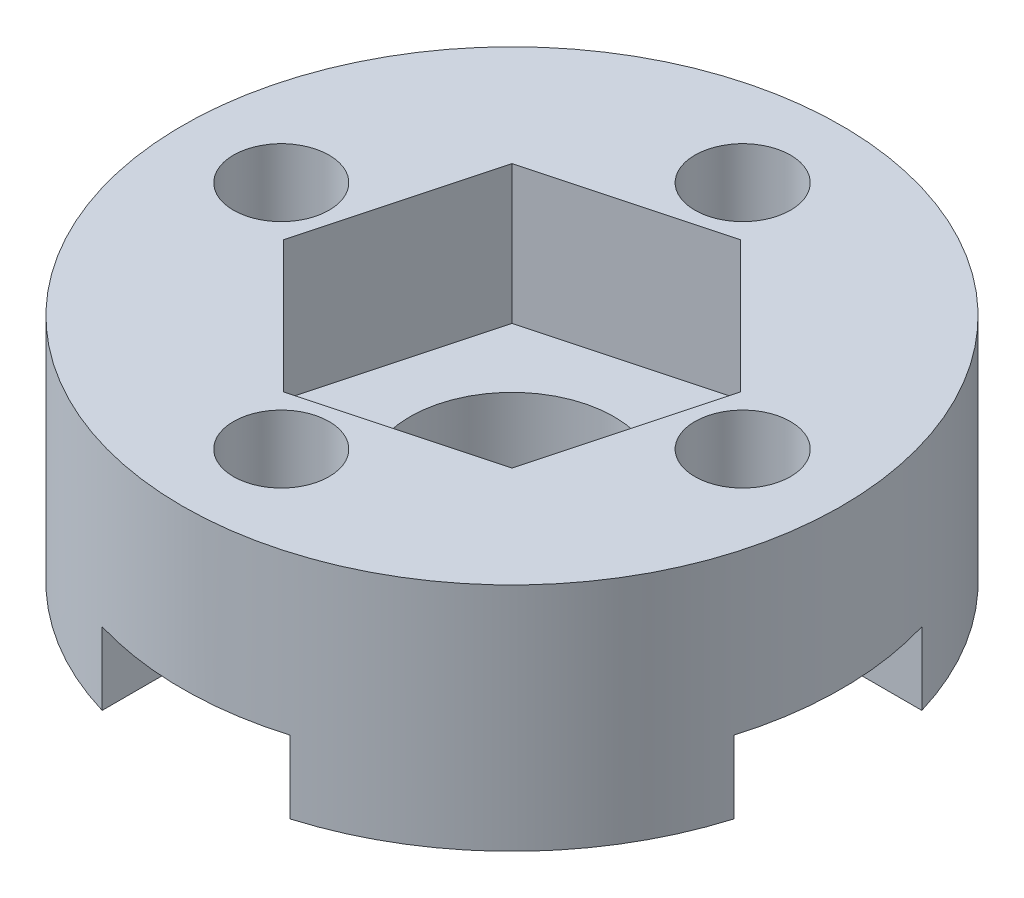
ISO-10303-21;
HEADER;
FILE_DESCRIPTION(('STEP AP214'),'2;1');
FILE_NAME('part.step','',(''),(''),'','','');
FILE_SCHEMA(('AUTOMOTIVE_DESIGN { 1 0 10303 214 1 1 1 1 }'));
ENDSEC;
DATA;
#1=APPLICATION_CONTEXT('core data for automotive mechanical design processes');
#2=APPLICATION_PROTOCOL_DEFINITION('international standard','automotive_design',2000,#1);
#3=PRODUCT_CONTEXT('',#1,'mechanical');
#4=PRODUCT('Part','Part','',(#3));
#5=PRODUCT_RELATED_PRODUCT_CATEGORY('part','',(#4));
#6=PRODUCT_DEFINITION_FORMATION('','',#4);
#7=PRODUCT_DEFINITION_CONTEXT('part definition',#1,'design');
#8=PRODUCT_DEFINITION('design','',#6,#7);
#9=PRODUCT_DEFINITION_SHAPE('','',#8);
#10=(LENGTH_UNIT() NAMED_UNIT(*) SI_UNIT(.MILLI.,.METRE.));
#11=(NAMED_UNIT(*) PLANE_ANGLE_UNIT() SI_UNIT($,.RADIAN.));
#12=(NAMED_UNIT(*) SI_UNIT($,.STERADIAN.) SOLID_ANGLE_UNIT());
#13=UNCERTAINTY_MEASURE_WITH_UNIT(LENGTH_MEASURE(1.E-05),#10,'distance_accuracy_value','');
#14=(GEOMETRIC_REPRESENTATION_CONTEXT(3) GLOBAL_UNCERTAINTY_ASSIGNED_CONTEXT((#13)) GLOBAL_UNIT_ASSIGNED_CONTEXT((#10,
#11,#12)) REPRESENTATION_CONTEXT('',''));
#15=CARTESIAN_POINT('',(0.,0.,0.));
#16=DIRECTION('',(0.,0.,1.));
#17=DIRECTION('',(1.,0.,0.));
#18=AXIS2_PLACEMENT_3D('',#15,#16,#17);
#19=CARTESIAN_POINT('',(0.,7.,0.));
#20=DIRECTION('',(0.,-1.,0.));
#21=DIRECTION('',(0.,0.,-1.));
#22=AXIS2_PLACEMENT_3D('',#19,#20,#21);
#23=CYLINDRICAL_SURFACE('',#22,3.1);
#24=CARTESIAN_POINT('',(0.,-1.,0.));
#25=DIRECTION('',(0.,-1.,0.));
#26=DIRECTION('',(0.,0.,-1.));
#27=AXIS2_PLACEMENT_3D('',#24,#25,#26);
#28=CIRCLE('',#27,3.1);
#29=CARTESIAN_POINT('',(0.,-1.,-3.1));
#30=VERTEX_POINT('',#29);
#31=EDGE_CURVE('E416',#30,#30,#28,.T.);
#32=ORIENTED_EDGE('',*,*,#31,.T.);
#33=EDGE_LOOP('',(#32));
#34=FACE_BOUND('',#33,.T.);
#35=CARTESIAN_POINT('',(0.,2.8,0.));
#36=DIRECTION('',(0.,1.,0.));
#37=DIRECTION('',(0.,0.,1.));
#38=AXIS2_PLACEMENT_3D('',#35,#36,#37);
#39=CIRCLE('',#38,3.1);
#40=CARTESIAN_POINT('',(0.,2.8,3.1));
#41=VERTEX_POINT('',#40);
#42=EDGE_CURVE('E36',#41,#41,#39,.T.);
#43=ORIENTED_EDGE('',*,*,#42,.T.);
#44=EDGE_LOOP('',(#43));
#45=FACE_BOUND('',#44,.T.);
#46=ADVANCED_FACE('F32',(#34,#45),#23,.F.);
#47=CARTESIAN_POINT('',(0.,0.,0.));
#48=DIRECTION('',(0.,1.,0.));
#49=DIRECTION('',(0.,0.,1.));
#50=AXIS2_PLACEMENT_3D('',#47,#48,#49);
#51=PLANE('',#50);
#52=DIRECTION('',(1.,0.,0.));
#53=VECTOR('',#52,1.);
#54=CARTESIAN_POINT('',(0.,0.,-2.85));
#55=LINE('',#54,#53);
#56=CARTESIAN_POINT('',(-9.58527516558604,0.,-2.8499999999999));
#57=VERTEX_POINT('',#56);
#58=CARTESIAN_POINT('',(-7.00000000000003,0.,-2.84999999999993));
#59=VERTEX_POINT('',#58);
#60=EDGE_CURVE('E414',#57,#59,#55,.T.);
#61=ORIENTED_EDGE('',*,*,#60,.F.);
#62=CARTESIAN_POINT('',(0.,0.,0.));
#63=DIRECTION('',(0.,1.,0.));
#64=DIRECTION('',(0.,0.,1.));
#65=AXIS2_PLACEMENT_3D('',#62,#63,#64);
#66=CIRCLE('',#65,10.);
#67=CARTESIAN_POINT('',(-2.85000000000007,0.,-9.58527516558599));
#68=VERTEX_POINT('',#67);
#69=EDGE_CURVE('E567',#68,#57,#66,.T.);
#70=ORIENTED_EDGE('',*,*,#69,.F.);
#71=DIRECTION('',(0.,0.,1.));
#72=VECTOR('',#71,1.);
#73=CARTESIAN_POINT('',(-2.85,0.,0.));
#74=LINE('',#73,#72);
#75=CARTESIAN_POINT('',(-2.85000000000005,0.,-6.99999999999998));
#76=VERTEX_POINT('',#75);
#77=EDGE_CURVE('E395',#68,#76,#74,.T.);
#78=ORIENTED_EDGE('',*,*,#77,.T.);
#79=CARTESIAN_POINT('',(0.,0.,-7.));
#80=DIRECTION('',(0.,1.,0.));
#81=DIRECTION('',(0.,0.,1.));
#82=AXIS2_PLACEMENT_3D('',#79,#80,#81);
#83=CIRCLE('',#82,2.85);
#84=CARTESIAN_POINT('',(-1.91425426413401,0.,-4.88857142857142));
#85=VERTEX_POINT('',#84);
#86=EDGE_CURVE('E384',#76,#85,#83,.T.);
#87=ORIENTED_EDGE('',*,*,#86,.T.);
#88=CARTESIAN_POINT('',(0.,0.,0.));
#89=DIRECTION('',(0.,1.,0.));
#90=DIRECTION('',(0.,0.,1.));
#91=AXIS2_PLACEMENT_3D('',#88,#89,#90);
#92=CIRCLE('',#91,5.25);
#93=CARTESIAN_POINT('',(-4.88857142857145,0.,-1.91425426413392));
#94=VERTEX_POINT('',#93);
#95=EDGE_CURVE('E449',#94,#85,#92,.F.);
#96=ORIENTED_EDGE('',*,*,#95,.F.);
#97=CARTESIAN_POINT('',(-7.,0.,0.));
#98=DIRECTION('',(0.,1.,0.));
#99=DIRECTION('',(0.,0.,1.));
#100=AXIS2_PLACEMENT_3D('',#97,#98,#99);
#101=CIRCLE('',#100,2.85);
#102=EDGE_CURVE('E391',#94,#59,#101,.T.);
#103=ORIENTED_EDGE('',*,*,#102,.T.);
#104=EDGE_LOOP('',(#61,#70,#78,#87,#96,#103));
#105=FACE_BOUND('',#104,.T.);
#106=ADVANCED_FACE('F566',(#105),#51,.F.);
#107=CARTESIAN_POINT('',(2.85,0.,9.58527516558601));
#108=VERTEX_POINT('',#107);
#109=CARTESIAN_POINT('',(9.58527516558602,0.,2.84999999999997));
#110=VERTEX_POINT('',#109);
#111=EDGE_CURVE('E441',#108,#110,#66,.T.);
#112=ORIENTED_EDGE('',*,*,#111,.F.);
#113=DIRECTION('',(0.,0.,-1.));
#114=VECTOR('',#113,1.);
#115=CARTESIAN_POINT('',(2.85,0.,0.));
#116=LINE('',#115,#114);
#117=CARTESIAN_POINT('',(2.85,0.,7.));
#118=VERTEX_POINT('',#117);
#119=EDGE_CURVE('E408',#108,#118,#116,.T.);
#120=ORIENTED_EDGE('',*,*,#119,.T.);
#121=CARTESIAN_POINT('',(0.,0.,7.));
#122=DIRECTION('',(0.,1.,0.));
#123=DIRECTION('',(0.,0.,1.));
#124=AXIS2_PLACEMENT_3D('',#121,#122,#123);
#125=CIRCLE('',#124,2.85);
#126=CARTESIAN_POINT('',(1.91425426413397,0.,4.88857142857143));
#127=VERTEX_POINT('',#126);
#128=EDGE_CURVE('E390',#118,#127,#125,.T.);
#129=ORIENTED_EDGE('',*,*,#128,.T.);
#130=CARTESIAN_POINT('',(4.88857142857144,0.,1.91425426413396));
#131=VERTEX_POINT('',#130);
#132=EDGE_CURVE('E440',#131,#127,#92,.F.);
#133=ORIENTED_EDGE('',*,*,#132,.F.);
#134=CARTESIAN_POINT('',(7.,0.,0.));
#135=DIRECTION('',(0.,1.,0.));
#136=DIRECTION('',(0.,0.,1.));
#137=AXIS2_PLACEMENT_3D('',#134,#135,#136);
#138=CIRCLE('',#137,2.85);
#139=CARTESIAN_POINT('',(7.00000000000001,0.,2.84999999999998));
#140=VERTEX_POINT('',#139);
#141=EDGE_CURVE('E57',#131,#140,#138,.T.);
#142=ORIENTED_EDGE('',*,*,#141,.T.);
#143=DIRECTION('',(-1.,0.,0.));
#144=VECTOR('',#143,1.);
#145=CARTESIAN_POINT('',(0.,0.,2.85));
#146=LINE('',#145,#144);
#147=EDGE_CURVE('E404',#110,#140,#146,.T.);
#148=ORIENTED_EDGE('',*,*,#147,.F.);
#149=EDGE_LOOP('',(#112,#120,#129,#133,#142,#148));
#150=FACE_BOUND('',#149,.T.);
#151=ADVANCED_FACE('F536',(#150),#51,.F.);
#152=CARTESIAN_POINT('',(-9.58527516558598,0.,2.8500000000001));
#153=VERTEX_POINT('',#152);
#154=CARTESIAN_POINT('',(-2.85,0.,9.58527516558601));
#155=VERTEX_POINT('',#154);
#156=EDGE_CURVE('E436',#153,#155,#66,.T.);
#157=ORIENTED_EDGE('',*,*,#156,.F.);
#158=DIRECTION('',(1.,0.,0.));
#159=VECTOR('',#158,1.);
#160=CARTESIAN_POINT('',(0.,0.,2.85));
#161=LINE('',#160,#159);
#162=CARTESIAN_POINT('',(-6.99999999999997,0.,2.85000000000007));
#163=VERTEX_POINT('',#162);
#164=EDGE_CURVE('E411',#153,#163,#161,.T.);
#165=ORIENTED_EDGE('',*,*,#164,.T.);
#166=CARTESIAN_POINT('',(-4.88857142857141,0.,1.91425426413403));
#167=VERTEX_POINT('',#166);
#168=EDGE_CURVE('E394',#163,#167,#101,.T.);
#169=ORIENTED_EDGE('',*,*,#168,.T.);
#170=CARTESIAN_POINT('',(-1.91425426413398,0.,4.88857142857143));
#171=VERTEX_POINT('',#170);
#172=EDGE_CURVE('E445',#171,#167,#92,.F.);
#173=ORIENTED_EDGE('',*,*,#172,.F.);
#174=CARTESIAN_POINT('',(-2.85,0.,7.));
#175=VERTEX_POINT('',#174);
#176=EDGE_CURVE('E387',#171,#175,#125,.T.);
#177=ORIENTED_EDGE('',*,*,#176,.T.);
#178=DIRECTION('',(0.,0.,-1.));
#179=VECTOR('',#178,1.);
#180=CARTESIAN_POINT('',(-2.85,0.,0.));
#181=LINE('',#180,#179);
#182=EDGE_CURVE('E406',#155,#175,#181,.T.);
#183=ORIENTED_EDGE('',*,*,#182,.F.);
#184=EDGE_LOOP('',(#157,#165,#169,#173,#177,#183));
#185=FACE_BOUND('',#184,.T.);
#186=ADVANCED_FACE('F553',(#185),#51,.F.);
#187=CARTESIAN_POINT('',(0.,7.,0.));
#188=DIRECTION('',(0.,-1.,0.));
#189=DIRECTION('',(0.,0.,-1.));
#190=AXIS2_PLACEMENT_3D('',#187,#188,#189);
#191=CYLINDRICAL_SURFACE('',#190,10.);
#192=CARTESIAN_POINT('',(0.,7.,0.));
#193=DIRECTION('',(0.,1.,0.));
#194=DIRECTION('',(0.,0.,1.));
#195=AXIS2_PLACEMENT_3D('',#192,#193,#194);
#196=CIRCLE('',#195,10.);
#197=CARTESIAN_POINT('',(0.,7.,10.));
#198=VERTEX_POINT('',#197);
#199=EDGE_CURVE('E437',#198,#198,#196,.T.);
#200=ORIENTED_EDGE('',*,*,#199,.F.);
#201=EDGE_LOOP('',(#200));
#202=FACE_BOUND('',#201,.T.);
#203=DIRECTION('',(0.,-1.,0.));
#204=VECTOR('',#203,1.);
#205=CARTESIAN_POINT('',(-9.58527516558604,2.2,-2.8499999999999));
#206=LINE('',#205,#204);
#207=CARTESIAN_POINT('',(-9.58527516558604,2.2,-2.8499999999999));
#208=VERTEX_POINT('',#207);
#209=EDGE_CURVE('E301',#208,#57,#206,.T.);
#210=ORIENTED_EDGE('',*,*,#209,.F.);
#211=CARTESIAN_POINT('',(0.,2.2,0.));
#212=DIRECTION('',(0.,-1.,0.));
#213=DIRECTION('',(0.,0.,-1.));
#214=AXIS2_PLACEMENT_3D('',#211,#212,#213);
#215=CIRCLE('',#214,10.);
#216=CARTESIAN_POINT('',(-9.58527516558598,2.2,2.8500000000001));
#217=VERTEX_POINT('',#216);
#218=EDGE_CURVE('E295',#217,#208,#215,.T.);
#219=ORIENTED_EDGE('',*,*,#218,.F.);
#220=DIRECTION('',(0.,-1.,0.));
#221=VECTOR('',#220,1.);
#222=CARTESIAN_POINT('',(-9.58527516558598,2.2,2.8500000000001));
#223=LINE('',#222,#221);
#224=EDGE_CURVE('E304',#217,#153,#223,.T.);
#225=ORIENTED_EDGE('',*,*,#224,.T.);
#226=ORIENTED_EDGE('',*,*,#156,.T.);
#227=DIRECTION('',(0.,-1.,0.));
#228=VECTOR('',#227,1.);
#229=CARTESIAN_POINT('',(-2.85,2.2,9.58527516558601));
#230=LINE('',#229,#228);
#231=CARTESIAN_POINT('',(-2.85,2.2,9.58527516558601));
#232=VERTEX_POINT('',#231);
#233=EDGE_CURVE('E332',#232,#155,#230,.T.);
#234=ORIENTED_EDGE('',*,*,#233,.F.);
#235=CARTESIAN_POINT('',(0.,2.2,0.));
#236=DIRECTION('',(0.,-1.,0.));
#237=DIRECTION('',(0.,0.,-1.));
#238=AXIS2_PLACEMENT_3D('',#235,#236,#237);
#239=CIRCLE('',#238,10.);
#240=CARTESIAN_POINT('',(2.85,2.2,9.58527516558601));
#241=VERTEX_POINT('',#240);
#242=EDGE_CURVE('E315',#241,#232,#239,.T.);
#243=ORIENTED_EDGE('',*,*,#242,.F.);
#244=DIRECTION('',(0.,-1.,0.));
#245=VECTOR('',#244,1.);
#246=CARTESIAN_POINT('',(2.85,2.2,9.58527516558601));
#247=LINE('',#246,#245);
#248=EDGE_CURVE('E324',#241,#108,#247,.T.);
#249=ORIENTED_EDGE('',*,*,#248,.T.);
#250=ORIENTED_EDGE('',*,*,#111,.T.);
#251=DIRECTION('',(0.,-1.,0.));
#252=VECTOR('',#251,1.);
#253=CARTESIAN_POINT('',(9.58527516558602,2.2,2.84999999999997));
#254=LINE('',#253,#252);
#255=CARTESIAN_POINT('',(9.58527516558602,2.2,2.84999999999997));
#256=VERTEX_POINT('',#255);
#257=EDGE_CURVE('E326',#256,#110,#254,.T.);
#258=ORIENTED_EDGE('',*,*,#257,.F.);
#259=CARTESIAN_POINT('',(0.,2.2,0.));
#260=DIRECTION('',(0.,-1.,0.));
#261=DIRECTION('',(0.,0.,-1.));
#262=AXIS2_PLACEMENT_3D('',#259,#260,#261);
#263=CIRCLE('',#262,10.);
#264=CARTESIAN_POINT('',(9.585275165586,2.2,-2.85000000000003));
#265=VERTEX_POINT('',#264);
#266=EDGE_CURVE('E345',#265,#256,#263,.T.);
#267=ORIENTED_EDGE('',*,*,#266,.F.);
#268=DIRECTION('',(0.,-1.,0.));
#269=VECTOR('',#268,1.);
#270=CARTESIAN_POINT('',(9.585275165586,2.2,-2.85000000000003));
#271=LINE('',#270,#269);
#272=CARTESIAN_POINT('',(9.585275165586,0.,-2.85000000000003));
#273=VERTEX_POINT('',#272);
#274=EDGE_CURVE('E352',#265,#273,#271,.T.);
#275=ORIENTED_EDGE('',*,*,#274,.T.);
#276=CARTESIAN_POINT('',(2.84999999999993,0.,-9.58527516558603));
#277=VERTEX_POINT('',#276);
#278=EDGE_CURVE('E444',#273,#277,#66,.T.);
#279=ORIENTED_EDGE('',*,*,#278,.T.);
#280=DIRECTION('',(0.,-1.,0.));
#281=VECTOR('',#280,1.);
#282=CARTESIAN_POINT('',(2.84999999999993,2.2,-9.58527516558603));
#283=LINE('',#282,#281);
#284=CARTESIAN_POINT('',(2.84999999999993,2.2,-9.58527516558603));
#285=VERTEX_POINT('',#284);
#286=EDGE_CURVE('E350',#285,#277,#283,.T.);
#287=ORIENTED_EDGE('',*,*,#286,.F.);
#288=CARTESIAN_POINT('',(0.,2.2,0.));
#289=DIRECTION('',(0.,-1.,0.));
#290=DIRECTION('',(0.,0.,-1.));
#291=AXIS2_PLACEMENT_3D('',#288,#289,#290);
#292=CIRCLE('',#291,10.);
#293=CARTESIAN_POINT('',(-2.85000000000007,2.2,-9.58527516558599));
#294=VERTEX_POINT('',#293);
#295=EDGE_CURVE('E368',#294,#285,#292,.T.);
#296=ORIENTED_EDGE('',*,*,#295,.F.);
#297=DIRECTION('',(0.,-1.,0.));
#298=VECTOR('',#297,1.);
#299=CARTESIAN_POINT('',(-2.85000000000007,2.2,-9.58527516558599));
#300=LINE('',#299,#298);
#301=EDGE_CURVE('E374',#294,#68,#300,.T.);
#302=ORIENTED_EDGE('',*,*,#301,.T.);
#303=ORIENTED_EDGE('',*,*,#69,.T.);
#304=EDGE_LOOP('',(#210,#219,#225,#226,#234,#243,#249,#250,#258,#267,#275,#279,#287,#296,#302,#303));
#305=FACE_BOUND('',#304,.T.);
#306=ADVANCED_FACE('F34',(#202,#305),#191,.T.);
#307=CARTESIAN_POINT('',(0.,7.,-7.));
#308=DIRECTION('',(0.,-1.,0.));
#309=DIRECTION('',(0.,0.,-1.));
#310=AXIS2_PLACEMENT_3D('',#307,#308,#309);
#311=CYLINDRICAL_SURFACE('',#310,1.45);
#312=CARTESIAN_POINT('',(0.,7.,-7.));
#313=DIRECTION('',(0.,1.,0.));
#314=DIRECTION('',(0.,0.,1.));
#315=AXIS2_PLACEMENT_3D('',#312,#313,#314);
#316=CIRCLE('',#315,1.45);
#317=CARTESIAN_POINT('',(0.,7.,-5.55));
#318=VERTEX_POINT('',#317);
#319=EDGE_CURVE('E433',#318,#318,#316,.T.);
#320=ORIENTED_EDGE('',*,*,#319,.T.);
#321=EDGE_LOOP('',(#320));
#322=FACE_BOUND('',#321,.T.);
#323=CARTESIAN_POINT('',(0.,2.2,-7.));
#324=DIRECTION('',(0.,-1.,0.));
#325=DIRECTION('',(0.,0.,-1.));
#326=AXIS2_PLACEMENT_3D('',#323,#324,#325);
#327=CIRCLE('',#326,1.45);
#328=CARTESIAN_POINT('',(0.,2.2,-8.45));
#329=VERTEX_POINT('',#328);
#330=EDGE_CURVE('E399',#329,#329,#327,.T.);
#331=ORIENTED_EDGE('',*,*,#330,.T.);
#332=EDGE_LOOP('',(#331));
#333=FACE_BOUND('',#332,.T.);
#334=ADVANCED_FACE('F479',(#322,#333),#311,.F.);
#335=CARTESIAN_POINT('',(7.,7.,0.));
#336=DIRECTION('',(0.,-1.,0.));
#337=DIRECTION('',(0.,0.,-1.));
#338=AXIS2_PLACEMENT_3D('',#335,#336,#337);
#339=CYLINDRICAL_SURFACE('',#338,1.45);
#340=CARTESIAN_POINT('',(7.,7.,0.));
#341=DIRECTION('',(0.,1.,0.));
#342=DIRECTION('',(0.,0.,1.));
#343=AXIS2_PLACEMENT_3D('',#340,#341,#342);
#344=CIRCLE('',#343,1.45);
#345=CARTESIAN_POINT('',(7.,7.,1.45));
#346=VERTEX_POINT('',#345);
#347=EDGE_CURVE('E430',#346,#346,#344,.T.);
#348=ORIENTED_EDGE('',*,*,#347,.T.);
#349=EDGE_LOOP('',(#348));
#350=FACE_BOUND('',#349,.T.);
#351=CARTESIAN_POINT('',(7.,2.2,0.));
#352=DIRECTION('',(0.,-1.,0.));
#353=DIRECTION('',(0.,0.,-1.));
#354=AXIS2_PLACEMENT_3D('',#351,#352,#353);
#355=CIRCLE('',#354,1.45);
#356=CARTESIAN_POINT('',(7.,2.2,-1.45));
#357=VERTEX_POINT('',#356);
#358=EDGE_CURVE('E474',#357,#357,#355,.T.);
#359=ORIENTED_EDGE('',*,*,#358,.T.);
#360=EDGE_LOOP('',(#359));
#361=FACE_BOUND('',#360,.T.);
#362=ADVANCED_FACE('F853',(#350,#361),#339,.F.);
#363=CARTESIAN_POINT('',(0.,7.,7.));
#364=DIRECTION('',(0.,-1.,0.));
#365=DIRECTION('',(0.,0.,-1.));
#366=AXIS2_PLACEMENT_3D('',#363,#364,#365);
#367=CYLINDRICAL_SURFACE('',#366,1.45);
#368=CARTESIAN_POINT('',(0.,7.,7.));
#369=DIRECTION('',(0.,1.,0.));
#370=DIRECTION('',(0.,0.,1.));
#371=AXIS2_PLACEMENT_3D('',#368,#369,#370);
#372=CIRCLE('',#371,1.45);
#373=CARTESIAN_POINT('',(0.,7.,8.45));
#374=VERTEX_POINT('',#373);
#375=EDGE_CURVE('E427',#374,#374,#372,.T.);
#376=ORIENTED_EDGE('',*,*,#375,.T.);
#377=EDGE_LOOP('',(#376));
#378=FACE_BOUND('',#377,.T.);
#379=CARTESIAN_POINT('',(0.,2.2,7.));
#380=DIRECTION('',(0.,-1.,0.));
#381=DIRECTION('',(0.,0.,-1.));
#382=AXIS2_PLACEMENT_3D('',#379,#380,#381);
#383=CIRCLE('',#382,1.45);
#384=CARTESIAN_POINT('',(0.,2.2,5.55));
#385=VERTEX_POINT('',#384);
#386=EDGE_CURVE('E471',#385,#385,#383,.T.);
#387=ORIENTED_EDGE('',*,*,#386,.T.);
#388=EDGE_LOOP('',(#387));
#389=FACE_BOUND('',#388,.T.);
#390=ADVANCED_FACE('F846',(#378,#389),#367,.F.);
#391=CARTESIAN_POINT('',(-7.,7.,0.));
#392=DIRECTION('',(0.,-1.,0.));
#393=DIRECTION('',(0.,0.,-1.));
#394=AXIS2_PLACEMENT_3D('',#391,#392,#393);
#395=CYLINDRICAL_SURFACE('',#394,1.45);
#396=CARTESIAN_POINT('',(-7.,7.,0.));
#397=DIRECTION('',(0.,1.,0.));
#398=DIRECTION('',(0.,0.,1.));
#399=AXIS2_PLACEMENT_3D('',#396,#397,#398);
#400=CIRCLE('',#399,1.45);
#401=CARTESIAN_POINT('',(-7.,7.,1.45));
#402=VERTEX_POINT('',#401);
#403=EDGE_CURVE('E423',#402,#402,#400,.T.);
#404=ORIENTED_EDGE('',*,*,#403,.T.);
#405=EDGE_LOOP('',(#404));
#406=FACE_BOUND('',#405,.T.);
#407=CARTESIAN_POINT('',(-7.,2.2,0.));
#408=DIRECTION('',(0.,-1.,0.));
#409=DIRECTION('',(0.,0.,-1.));
#410=AXIS2_PLACEMENT_3D('',#407,#408,#409);
#411=CIRCLE('',#410,1.45);
#412=CARTESIAN_POINT('',(-7.,2.2,-1.45));
#413=VERTEX_POINT('',#412);
#414=EDGE_CURVE('E468',#413,#413,#411,.T.);
#415=ORIENTED_EDGE('',*,*,#414,.T.);
#416=EDGE_LOOP('',(#415));
#417=FACE_BOUND('',#416,.T.);
#418=ADVANCED_FACE('F843',(#406,#417),#395,.F.);
#419=CARTESIAN_POINT('',(0.,-1.,0.));
#420=DIRECTION('',(0.,1.,0.));
#421=DIRECTION('',(0.,0.,1.));
#422=AXIS2_PLACEMENT_3D('',#419,#420,#421);
#423=CYLINDRICAL_SURFACE('',#422,5.25);
#424=ORIENTED_EDGE('',*,*,#172,.T.);
#425=DIRECTION('',(0.,-1.,0.));
#426=VECTOR('',#425,1.);
#427=CARTESIAN_POINT('',(-4.88857142857141,-0.5,1.91425426413403));
#428=LINE('',#427,#426);
#429=CARTESIAN_POINT('',(-4.88857142857141,-1.,1.91425426413403));
#430=VERTEX_POINT('',#429);
#431=EDGE_CURVE('E11',#167,#430,#428,.T.);
#432=ORIENTED_EDGE('',*,*,#431,.T.);
#433=CARTESIAN_POINT('',(0.,-1.,0.));
#434=DIRECTION('',(0.,-1.,0.));
#435=DIRECTION('',(0.,0.,-1.));
#436=AXIS2_PLACEMENT_3D('',#433,#434,#435);
#437=CIRCLE('',#436,5.25);
#438=CARTESIAN_POINT('',(-1.91425426413397,-1.,4.88857142857143));
#439=VERTEX_POINT('',#438);
#440=EDGE_CURVE('E560',#439,#430,#437,.T.);
#441=ORIENTED_EDGE('',*,*,#440,.F.);
#442=DIRECTION('',(0.,-1.,0.));
#443=VECTOR('',#442,1.);
#444=CARTESIAN_POINT('',(-1.91425426413397,-0.5,4.88857142857143));
#445=LINE('',#444,#443);
#446=EDGE_CURVE('E460',#439,#171,#445,.F.);
#447=ORIENTED_EDGE('',*,*,#446,.T.);
#448=EDGE_LOOP('',(#424,#432,#441,#447));
#449=FACE_BOUND('',#448,.T.);
#450=ADVANCED_FACE('F557',(#449),#423,.T.);
#451=ORIENTED_EDGE('',*,*,#132,.T.);
#452=DIRECTION('',(0.,-1.,0.));
#453=VECTOR('',#452,1.);
#454=CARTESIAN_POINT('',(1.91425426413397,-0.5,4.88857142857143));
#455=LINE('',#454,#453);
#456=CARTESIAN_POINT('',(1.91425426413398,-1.,4.88857142857143));
#457=VERTEX_POINT('',#456);
#458=EDGE_CURVE('E463',#127,#457,#455,.T.);
#459=ORIENTED_EDGE('',*,*,#458,.T.);
#460=CARTESIAN_POINT('',(4.88857142857144,-1.,1.91425426413396));
#461=VERTEX_POINT('',#460);
#462=EDGE_CURVE('E424',#461,#457,#437,.T.);
#463=ORIENTED_EDGE('',*,*,#462,.F.);
#464=DIRECTION('',(0.,-1.,0.));
#465=VECTOR('',#464,1.);
#466=CARTESIAN_POINT('',(4.88857142857144,-0.5,1.91425426413396));
#467=LINE('',#466,#465);
#468=EDGE_CURVE('E455',#461,#131,#467,.F.);
#469=ORIENTED_EDGE('',*,*,#468,.T.);
#470=EDGE_LOOP('',(#451,#459,#463,#469));
#471=FACE_BOUND('',#470,.T.);
#472=ADVANCED_FACE('F532',(#471),#423,.T.);
#473=CARTESIAN_POINT('',(1.91425426413394,0.,-4.88857142857144));
#474=VERTEX_POINT('',#473);
#475=CARTESIAN_POINT('',(4.88857142857142,0.,-1.91425426413399));
#476=VERTEX_POINT('',#475);
#477=EDGE_CURVE('E510',#474,#476,#92,.F.);
#478=ORIENTED_EDGE('',*,*,#477,.T.);
#479=DIRECTION('',(0.,-1.,0.));
#480=VECTOR('',#479,1.);
#481=CARTESIAN_POINT('',(4.88857142857142,-0.5,-1.91425426413399));
#482=LINE('',#481,#480);
#483=CARTESIAN_POINT('',(4.88857142857142,-1.,-1.91425426413399));
#484=VERTEX_POINT('',#483);
#485=EDGE_CURVE('E457',#476,#484,#482,.T.);
#486=ORIENTED_EDGE('',*,*,#485,.T.);
#487=CARTESIAN_POINT('',(1.91425426413394,-1.,-4.88857142857144));
#488=VERTEX_POINT('',#487);
#489=EDGE_CURVE('E420',#488,#484,#437,.T.);
#490=ORIENTED_EDGE('',*,*,#489,.F.);
#491=DIRECTION('',(0.,-1.,0.));
#492=VECTOR('',#491,1.);
#493=CARTESIAN_POINT('',(1.91425426413394,-0.5,-4.88857142857144));
#494=LINE('',#493,#492);
#495=EDGE_CURVE('E448',#488,#474,#494,.F.);
#496=ORIENTED_EDGE('',*,*,#495,.T.);
#497=EDGE_LOOP('',(#478,#486,#490,#496));
#498=FACE_BOUND('',#497,.T.);
#499=ADVANCED_FACE('F514',(#498),#423,.T.);
#500=ORIENTED_EDGE('',*,*,#278,.F.);
#501=DIRECTION('',(-1.,0.,0.));
#502=VECTOR('',#501,1.);
#503=CARTESIAN_POINT('',(0.,0.,-2.85));
#504=LINE('',#503,#502);
#505=CARTESIAN_POINT('',(6.99999999999999,0.,-2.85000000000003));
#506=VERTEX_POINT('',#505);
#507=EDGE_CURVE('E401',#273,#506,#504,.T.);
#508=ORIENTED_EDGE('',*,*,#507,.T.);
#509=EDGE_CURVE('E386',#506,#476,#138,.T.);
#510=ORIENTED_EDGE('',*,*,#509,.T.);
#511=ORIENTED_EDGE('',*,*,#477,.F.);
#512=CARTESIAN_POINT('',(2.84999999999995,0.,-7.00000000000002));
#513=VERTEX_POINT('',#512);
#514=EDGE_CURVE('E303',#474,#513,#83,.T.);
#515=ORIENTED_EDGE('',*,*,#514,.T.);
#516=DIRECTION('',(0.,0.,1.));
#517=VECTOR('',#516,1.);
#518=CARTESIAN_POINT('',(2.85,0.,0.));
#519=LINE('',#518,#517);
#520=EDGE_CURVE('E398',#277,#513,#519,.T.);
#521=ORIENTED_EDGE('',*,*,#520,.F.);
#522=EDGE_LOOP('',(#500,#508,#510,#511,#515,#521));
#523=FACE_BOUND('',#522,.T.);
#524=ADVANCED_FACE('F506',(#523),#51,.F.);
#525=CARTESIAN_POINT('',(0.,7.,0.));
#526=DIRECTION('',(0.,1.,0.));
#527=DIRECTION('',(0.,0.,1.));
#528=AXIS2_PLACEMENT_3D('',#525,#526,#527);
#529=PLANE('',#528);
#530=DIRECTION('',(-0.707106781186548,0.,-0.707106781186547));
#531=VECTOR('',#530,1.);
#532=CARTESIAN_POINT('',(5.46523985108701,7.,-1.46440660454116));
#533=LINE('',#532,#531);
#534=CARTESIAN_POINT('',(5.46523985108701,7.,-1.46440660454116));
#535=VERTEX_POINT('',#534);
#536=CARTESIAN_POINT('',(1.46440660454115,7.,-5.46523985108701));
#537=VERTEX_POINT('',#536);
#538=EDGE_CURVE('E49',#535,#537,#533,.T.);
#539=ORIENTED_EDGE('',*,*,#538,.F.);
#540=DIRECTION('',(0.25881904510252,0.,-0.965925826289069));
#541=VECTOR('',#540,1.);
#542=CARTESIAN_POINT('',(4.00083324654586,7.,4.00083324654585));
#543=LINE('',#542,#541);
#544=CARTESIAN_POINT('',(4.00083324654586,7.,4.00083324654585));
#545=VERTEX_POINT('',#544);
#546=EDGE_CURVE('E253',#545,#535,#543,.T.);
#547=ORIENTED_EDGE('',*,*,#546,.F.);
#548=DIRECTION('',(0.965925826289068,0.,-0.258819045102522));
#549=VECTOR('',#548,1.);
#550=CARTESIAN_POINT('',(-1.46440660454115,7.,5.46523985108701));
#551=LINE('',#550,#549);
#552=CARTESIAN_POINT('',(-1.46440660454115,7.,5.46523985108701));
#553=VERTEX_POINT('',#552);
#554=EDGE_CURVE('E256',#553,#545,#551,.T.);
#555=ORIENTED_EDGE('',*,*,#554,.F.);
#556=DIRECTION('',(0.707106781186548,0.,0.707106781186547));
#557=VECTOR('',#556,1.);
#558=CARTESIAN_POINT('',(-5.46523985108701,7.,1.46440660454116));
#559=LINE('',#558,#557);
#560=CARTESIAN_POINT('',(-5.46523985108701,7.,1.46440660454116));
#561=VERTEX_POINT('',#560);
#562=EDGE_CURVE('E272',#561,#553,#559,.T.);
#563=ORIENTED_EDGE('',*,*,#562,.F.);
#564=DIRECTION('',(-0.25881904510252,0.,0.965925826289069));
#565=VECTOR('',#564,1.);
#566=CARTESIAN_POINT('',(-4.00083324654586,7.,-4.00083324654585));
#567=LINE('',#566,#565);
#568=CARTESIAN_POINT('',(-4.00083324654586,7.,-4.00083324654585));
#569=VERTEX_POINT('',#568);
#570=EDGE_CURVE('E269',#569,#561,#567,.T.);
#571=ORIENTED_EDGE('',*,*,#570,.F.);
#572=DIRECTION('',(-0.965925826289068,0.,0.258819045102522));
#573=VECTOR('',#572,1.);
#574=CARTESIAN_POINT('',(1.46440660454115,7.,-5.46523985108702));
#575=LINE('',#574,#573);
#576=EDGE_CURVE('E267',#537,#569,#575,.T.);
#577=ORIENTED_EDGE('',*,*,#576,.F.);
#578=EDGE_LOOP('',(#539,#547,#555,#563,#571,#577));
#579=FACE_BOUND('',#578,.T.);
#580=ORIENTED_EDGE('',*,*,#375,.F.);
#581=EDGE_LOOP('',(#580));
#582=FACE_BOUND('',#581,.T.);
#583=ORIENTED_EDGE('',*,*,#319,.F.);
#584=EDGE_LOOP('',(#583));
#585=FACE_BOUND('',#584,.T.);
#586=ORIENTED_EDGE('',*,*,#199,.T.);
#587=EDGE_LOOP('',(#586));
#588=FACE_BOUND('',#587,.T.);
#589=ORIENTED_EDGE('',*,*,#347,.F.);
#590=EDGE_LOOP('',(#589));
#591=FACE_BOUND('',#590,.T.);
#592=ORIENTED_EDGE('',*,*,#403,.F.);
#593=EDGE_LOOP('',(#592));
#594=FACE_BOUND('',#593,.T.);
#595=ADVANCED_FACE('F598',(#579,#582,#585,#588,#591,#594),#529,.T.);
#596=CARTESIAN_POINT('',(0.,-1.,0.));
#597=DIRECTION('',(0.,-1.,0.));
#598=DIRECTION('',(0.,0.,-1.));
#599=AXIS2_PLACEMENT_3D('',#596,#597,#598);
#600=PLANE('',#599);
#601=CARTESIAN_POINT('',(-7.,-1.,0.));
#602=DIRECTION('',(0.,-1.,0.));
#603=DIRECTION('',(0.,0.,-1.));
#604=AXIS2_PLACEMENT_3D('',#601,#602,#603);
#605=CIRCLE('',#604,2.85);
#606=CARTESIAN_POINT('',(-4.88857142857145,-1.,-1.91425426413392));
#607=VERTEX_POINT('',#606);
#608=EDGE_CURVE('E289',#607,#430,#605,.T.);
#609=ORIENTED_EDGE('',*,*,#608,.F.);
#610=CARTESIAN_POINT('',(-1.91425426413401,-1.,-4.88857142857141));
#611=VERTEX_POINT('',#610);
#612=EDGE_CURVE('E419',#607,#611,#437,.T.);
#613=ORIENTED_EDGE('',*,*,#612,.T.);
#614=CARTESIAN_POINT('',(0.,-1.,-7.));
#615=DIRECTION('',(0.,-1.,0.));
#616=DIRECTION('',(0.,0.,-1.));
#617=AXIS2_PLACEMENT_3D('',#614,#615,#616);
#618=CIRCLE('',#617,2.85);
#619=EDGE_CURVE('E362',#488,#611,#618,.T.);
#620=ORIENTED_EDGE('',*,*,#619,.F.);
#621=ORIENTED_EDGE('',*,*,#489,.T.);
#622=CARTESIAN_POINT('',(7.,-1.,0.));
#623=DIRECTION('',(0.,-1.,0.));
#624=DIRECTION('',(0.,0.,-1.));
#625=AXIS2_PLACEMENT_3D('',#622,#623,#624);
#626=CIRCLE('',#625,2.85);
#627=EDGE_CURVE('E339',#461,#484,#626,.T.);
#628=ORIENTED_EDGE('',*,*,#627,.F.);
#629=ORIENTED_EDGE('',*,*,#462,.T.);
#630=CARTESIAN_POINT('',(0.,-1.,7.));
#631=DIRECTION('',(0.,-1.,0.));
#632=DIRECTION('',(0.,0.,-1.));
#633=AXIS2_PLACEMENT_3D('',#630,#631,#632);
#634=CIRCLE('',#633,2.85);
#635=EDGE_CURVE('E316',#439,#457,#634,.T.);
#636=ORIENTED_EDGE('',*,*,#635,.F.);
#637=ORIENTED_EDGE('',*,*,#440,.T.);
#638=EDGE_LOOP('',(#609,#613,#620,#621,#628,#629,#636,#637));
#639=FACE_BOUND('',#638,.T.);
#640=ORIENTED_EDGE('',*,*,#31,.F.);
#641=EDGE_LOOP('',(#640));
#642=FACE_BOUND('',#641,.T.);
#643=ADVANCED_FACE('F518',(#639,#642),#600,.T.);
#644=ORIENTED_EDGE('',*,*,#612,.F.);
#645=DIRECTION('',(0.,-1.,0.));
#646=VECTOR('',#645,1.);
#647=CARTESIAN_POINT('',(-4.88857142857145,-0.5,-1.91425426413392));
#648=LINE('',#647,#646);
#649=EDGE_CURVE('E41',#607,#94,#648,.F.);
#650=ORIENTED_EDGE('',*,*,#649,.T.);
#651=ORIENTED_EDGE('',*,*,#95,.T.);
#652=DIRECTION('',(0.,-1.,0.));
#653=VECTOR('',#652,1.);
#654=CARTESIAN_POINT('',(-1.91425426413401,-0.5,-4.88857142857141));
#655=LINE('',#654,#653);
#656=EDGE_CURVE('E452',#85,#611,#655,.T.);
#657=ORIENTED_EDGE('',*,*,#656,.T.);
#658=EDGE_LOOP('',(#644,#650,#651,#657));
#659=FACE_BOUND('',#658,.T.);
#660=ADVANCED_FACE('F526',(#659),#423,.T.);
#661=CARTESIAN_POINT('',(2.85,2.2,0.));
#662=DIRECTION('',(-1.,0.,0.));
#663=DIRECTION('',(0.,0.,1.));
#664=AXIS2_PLACEMENT_3D('',#661,#662,#663);
#665=PLANE('',#664);
#666=ORIENTED_EDGE('',*,*,#520,.T.);
#667=DIRECTION('',(0.,-1.,0.));
#668=VECTOR('',#667,1.);
#669=CARTESIAN_POINT('',(2.84999999999995,2.2,-7.00000000000002));
#670=LINE('',#669,#668);
#671=CARTESIAN_POINT('',(2.84999999999995,2.2,-7.00000000000002));
#672=VERTEX_POINT('',#671);
#673=EDGE_CURVE('E371',#672,#513,#670,.T.);
#674=ORIENTED_EDGE('',*,*,#673,.F.);
#675=DIRECTION('',(0.,0.,-1.));
#676=VECTOR('',#675,1.);
#677=CARTESIAN_POINT('',(2.85,2.2,0.));
#678=LINE('',#677,#676);
#679=EDGE_CURVE('E359',#672,#285,#678,.T.);
#680=ORIENTED_EDGE('',*,*,#679,.T.);
#681=ORIENTED_EDGE('',*,*,#286,.T.);
#682=EDGE_LOOP('',(#666,#674,#680,#681));
#683=FACE_BOUND('',#682,.T.);
#684=ADVANCED_FACE('F504',(#683),#665,.T.);
#685=CARTESIAN_POINT('',(-2.85,2.2,0.));
#686=DIRECTION('',(-1.,0.,0.));
#687=DIRECTION('',(0.,0.,1.));
#688=AXIS2_PLACEMENT_3D('',#685,#686,#687);
#689=PLANE('',#688);
#690=ORIENTED_EDGE('',*,*,#301,.F.);
#691=DIRECTION('',(0.,0.,-1.));
#692=VECTOR('',#691,1.);
#693=CARTESIAN_POINT('',(-2.85,2.2,0.));
#694=LINE('',#693,#692);
#695=CARTESIAN_POINT('',(-2.85000000000005,2.2,-6.99999999999998));
#696=VERTEX_POINT('',#695);
#697=EDGE_CURVE('E365',#696,#294,#694,.T.);
#698=ORIENTED_EDGE('',*,*,#697,.F.);
#699=DIRECTION('',(0.,-1.,0.));
#700=VECTOR('',#699,1.);
#701=CARTESIAN_POINT('',(-2.85000000000005,2.2,-6.99999999999998));
#702=LINE('',#701,#700);
#703=EDGE_CURVE('E377',#696,#76,#702,.T.);
#704=ORIENTED_EDGE('',*,*,#703,.T.);
#705=ORIENTED_EDGE('',*,*,#77,.F.);
#706=EDGE_LOOP('',(#690,#698,#704,#705));
#707=FACE_BOUND('',#706,.T.);
#708=ADVANCED_FACE('F496',(#707),#689,.F.);
#709=CARTESIAN_POINT('',(0.,2.2,-7.));
#710=DIRECTION('',(0.,-1.,0.));
#711=DIRECTION('',(0.,0.,-1.));
#712=AXIS2_PLACEMENT_3D('',#709,#710,#711);
#713=CYLINDRICAL_SURFACE('',#712,2.85);
#714=ORIENTED_EDGE('',*,*,#703,.F.);
#715=CARTESIAN_POINT('',(0.,2.2,-7.));
#716=DIRECTION('',(0.,-1.,0.));
#717=DIRECTION('',(0.,0.,-1.));
#718=AXIS2_PLACEMENT_3D('',#715,#716,#717);
#719=CIRCLE('',#718,2.85);
#720=EDGE_CURVE('E361',#672,#696,#719,.T.);
#721=ORIENTED_EDGE('',*,*,#720,.F.);
#722=ORIENTED_EDGE('',*,*,#673,.T.);
#723=ORIENTED_EDGE('',*,*,#514,.F.);
#724=ORIENTED_EDGE('',*,*,#495,.F.);
#725=ORIENTED_EDGE('',*,*,#619,.T.);
#726=ORIENTED_EDGE('',*,*,#656,.F.);
#727=ORIENTED_EDGE('',*,*,#86,.F.);
#728=EDGE_LOOP('',(#714,#721,#722,#723,#724,#725,#726,#727));
#729=FACE_BOUND('',#728,.T.);
#730=ADVANCED_FACE('F485',(#729),#713,.F.);
#731=CARTESIAN_POINT('',(0.,2.2,0.));
#732=DIRECTION('',(0.,-1.,0.));
#733=DIRECTION('',(0.,0.,-1.));
#734=AXIS2_PLACEMENT_3D('',#731,#732,#733);
#735=PLANE('',#734);
#736=ORIENTED_EDGE('',*,*,#330,.F.);
#737=EDGE_LOOP('',(#736));
#738=FACE_BOUND('',#737,.T.);
#739=ORIENTED_EDGE('',*,*,#679,.F.);
#740=ORIENTED_EDGE('',*,*,#720,.T.);
#741=ORIENTED_EDGE('',*,*,#697,.T.);
#742=ORIENTED_EDGE('',*,*,#295,.T.);
#743=EDGE_LOOP('',(#739,#740,#741,#742));
#744=FACE_BOUND('',#743,.T.);
#745=ADVANCED_FACE('F481',(#738,#744),#735,.T.);
#746=CARTESIAN_POINT('',(0.,2.2,2.85));
#747=DIRECTION('',(0.,0.,-1.));
#748=DIRECTION('',(-1.,0.,0.));
#749=AXIS2_PLACEMENT_3D('',#746,#747,#748);
#750=PLANE('',#749);
#751=ORIENTED_EDGE('',*,*,#147,.T.);
#752=DIRECTION('',(0.,-1.,0.));
#753=VECTOR('',#752,1.);
#754=CARTESIAN_POINT('',(7.00000000000001,2.2,2.84999999999998));
#755=LINE('',#754,#753);
#756=CARTESIAN_POINT('',(7.00000000000001,2.2,2.84999999999998));
#757=VERTEX_POINT('',#756);
#758=EDGE_CURVE('E348',#757,#140,#755,.T.);
#759=ORIENTED_EDGE('',*,*,#758,.F.);
#760=DIRECTION('',(1.,0.,0.));
#761=VECTOR('',#760,1.);
#762=CARTESIAN_POINT('',(0.,2.2,2.85));
#763=LINE('',#762,#761);
#764=EDGE_CURVE('E336',#757,#256,#763,.T.);
#765=ORIENTED_EDGE('',*,*,#764,.T.);
#766=ORIENTED_EDGE('',*,*,#257,.T.);
#767=EDGE_LOOP('',(#751,#759,#765,#766));
#768=FACE_BOUND('',#767,.T.);
#769=ADVANCED_FACE('F484',(#768),#750,.T.);
#770=CARTESIAN_POINT('',(0.,2.2,-2.85));
#771=DIRECTION('',(0.,0.,-1.));
#772=DIRECTION('',(-1.,0.,0.));
#773=AXIS2_PLACEMENT_3D('',#770,#771,#772);
#774=PLANE('',#773);
#775=ORIENTED_EDGE('',*,*,#274,.F.);
#776=DIRECTION('',(1.,0.,0.));
#777=VECTOR('',#776,1.);
#778=CARTESIAN_POINT('',(0.,2.2,-2.85));
#779=LINE('',#778,#777);
#780=CARTESIAN_POINT('',(6.99999999999999,2.2,-2.85000000000003));
#781=VERTEX_POINT('',#780);
#782=EDGE_CURVE('E342',#781,#265,#779,.T.);
#783=ORIENTED_EDGE('',*,*,#782,.F.);
#784=DIRECTION('',(0.,-1.,0.));
#785=VECTOR('',#784,1.);
#786=CARTESIAN_POINT('',(6.99999999999999,2.2,-2.85000000000003));
#787=LINE('',#786,#785);
#788=EDGE_CURVE('E355',#781,#506,#787,.T.);
#789=ORIENTED_EDGE('',*,*,#788,.T.);
#790=ORIENTED_EDGE('',*,*,#507,.F.);
#791=EDGE_LOOP('',(#775,#783,#789,#790));
#792=FACE_BOUND('',#791,.T.);
#793=ADVANCED_FACE('F661',(#792),#774,.F.);
#794=CARTESIAN_POINT('',(7.,2.2,0.));
#795=DIRECTION('',(0.,-1.,0.));
#796=DIRECTION('',(0.,0.,-1.));
#797=AXIS2_PLACEMENT_3D('',#794,#795,#796);
#798=CYLINDRICAL_SURFACE('',#797,2.85);
#799=ORIENTED_EDGE('',*,*,#788,.F.);
#800=CARTESIAN_POINT('',(7.,2.2,0.));
#801=DIRECTION('',(0.,-1.,0.));
#802=DIRECTION('',(0.,0.,-1.));
#803=AXIS2_PLACEMENT_3D('',#800,#801,#802);
#804=CIRCLE('',#803,2.85);
#805=EDGE_CURVE('E338',#757,#781,#804,.T.);
#806=ORIENTED_EDGE('',*,*,#805,.F.);
#807=ORIENTED_EDGE('',*,*,#758,.T.);
#808=ORIENTED_EDGE('',*,*,#141,.F.);
#809=ORIENTED_EDGE('',*,*,#468,.F.);
#810=ORIENTED_EDGE('',*,*,#627,.T.);
#811=ORIENTED_EDGE('',*,*,#485,.F.);
#812=ORIENTED_EDGE('',*,*,#509,.F.);
#813=EDGE_LOOP('',(#799,#806,#807,#808,#809,#810,#811,#812));
#814=FACE_BOUND('',#813,.T.);
#815=ADVANCED_FACE('F670',(#814),#798,.F.);
#816=CARTESIAN_POINT('',(0.,2.2,0.));
#817=DIRECTION('',(0.,-1.,0.));
#818=DIRECTION('',(0.,0.,-1.));
#819=AXIS2_PLACEMENT_3D('',#816,#817,#818);
#820=PLANE('',#819);
#821=ORIENTED_EDGE('',*,*,#358,.F.);
#822=EDGE_LOOP('',(#821));
#823=FACE_BOUND('',#822,.T.);
#824=ORIENTED_EDGE('',*,*,#764,.F.);
#825=ORIENTED_EDGE('',*,*,#805,.T.);
#826=ORIENTED_EDGE('',*,*,#782,.T.);
#827=ORIENTED_EDGE('',*,*,#266,.T.);
#828=EDGE_LOOP('',(#824,#825,#826,#827));
#829=FACE_BOUND('',#828,.T.);
#830=ADVANCED_FACE('F679',(#823,#829),#820,.T.);
#831=CARTESIAN_POINT('',(2.85,2.2,0.));
#832=DIRECTION('',(1.,0.,0.));
#833=DIRECTION('',(0.,0.,-1.));
#834=AXIS2_PLACEMENT_3D('',#831,#832,#833);
#835=PLANE('',#834);
#836=ORIENTED_EDGE('',*,*,#248,.F.);
#837=DIRECTION('',(0.,0.,1.));
#838=VECTOR('',#837,1.);
#839=CARTESIAN_POINT('',(2.85,2.2,0.));
#840=LINE('',#839,#838);
#841=CARTESIAN_POINT('',(2.85,2.2,7.));
#842=VERTEX_POINT('',#841);
#843=EDGE_CURVE('E312',#842,#241,#840,.T.);
#844=ORIENTED_EDGE('',*,*,#843,.F.);
#845=DIRECTION('',(0.,-1.,0.));
#846=VECTOR('',#845,1.);
#847=CARTESIAN_POINT('',(2.85,2.2,7.));
#848=LINE('',#847,#846);
#849=EDGE_CURVE('E300',#842,#118,#848,.T.);
#850=ORIENTED_EDGE('',*,*,#849,.T.);
#851=ORIENTED_EDGE('',*,*,#119,.F.);
#852=EDGE_LOOP('',(#836,#844,#850,#851));
#853=FACE_BOUND('',#852,.T.);
#854=ADVANCED_FACE('F543',(#853),#835,.F.);
#855=CARTESIAN_POINT('',(-2.85,2.2,0.));
#856=DIRECTION('',(1.,0.,0.));
#857=DIRECTION('',(0.,0.,-1.));
#858=AXIS2_PLACEMENT_3D('',#855,#856,#857);
#859=PLANE('',#858);
#860=ORIENTED_EDGE('',*,*,#182,.T.);
#861=DIRECTION('',(0.,-1.,0.));
#862=VECTOR('',#861,1.);
#863=CARTESIAN_POINT('',(-2.85,2.2,7.));
#864=LINE('',#863,#862);
#865=CARTESIAN_POINT('',(-2.85,2.2,7.));
#866=VERTEX_POINT('',#865);
#867=EDGE_CURVE('E329',#866,#175,#864,.T.);
#868=ORIENTED_EDGE('',*,*,#867,.F.);
#869=DIRECTION('',(0.,0.,1.));
#870=VECTOR('',#869,1.);
#871=CARTESIAN_POINT('',(-2.85,2.2,0.));
#872=LINE('',#871,#870);
#873=EDGE_CURVE('E319',#866,#232,#872,.T.);
#874=ORIENTED_EDGE('',*,*,#873,.T.);
#875=ORIENTED_EDGE('',*,*,#233,.T.);
#876=EDGE_LOOP('',(#860,#868,#874,#875));
#877=FACE_BOUND('',#876,.T.);
#878=ADVANCED_FACE('F698',(#877),#859,.T.);
#879=CARTESIAN_POINT('',(0.,2.2,7.));
#880=DIRECTION('',(0.,-1.,0.));
#881=DIRECTION('',(0.,0.,-1.));
#882=AXIS2_PLACEMENT_3D('',#879,#880,#881);
#883=CYLINDRICAL_SURFACE('',#882,2.85);
#884=ORIENTED_EDGE('',*,*,#849,.F.);
#885=CARTESIAN_POINT('',(0.,2.2,7.));
#886=DIRECTION('',(0.,-1.,0.));
#887=DIRECTION('',(0.,0.,-1.));
#888=AXIS2_PLACEMENT_3D('',#885,#886,#887);
#889=CIRCLE('',#888,2.85);
#890=EDGE_CURVE('E321',#866,#842,#889,.T.);
#891=ORIENTED_EDGE('',*,*,#890,.F.);
#892=ORIENTED_EDGE('',*,*,#867,.T.);
#893=ORIENTED_EDGE('',*,*,#176,.F.);
#894=ORIENTED_EDGE('',*,*,#446,.F.);
#895=ORIENTED_EDGE('',*,*,#635,.T.);
#896=ORIENTED_EDGE('',*,*,#458,.F.);
#897=ORIENTED_EDGE('',*,*,#128,.F.);
#898=EDGE_LOOP('',(#884,#891,#892,#893,#894,#895,#896,#897));
#899=FACE_BOUND('',#898,.T.);
#900=ADVANCED_FACE('F539',(#899),#883,.F.);
#901=CARTESIAN_POINT('',(0.,2.2,0.));
#902=DIRECTION('',(0.,-1.,0.));
#903=DIRECTION('',(0.,0.,-1.));
#904=AXIS2_PLACEMENT_3D('',#901,#902,#903);
#905=PLANE('',#904);
#906=ORIENTED_EDGE('',*,*,#386,.F.);
#907=EDGE_LOOP('',(#906));
#908=FACE_BOUND('',#907,.T.);
#909=ORIENTED_EDGE('',*,*,#843,.T.);
#910=ORIENTED_EDGE('',*,*,#242,.T.);
#911=ORIENTED_EDGE('',*,*,#873,.F.);
#912=ORIENTED_EDGE('',*,*,#890,.T.);
#913=EDGE_LOOP('',(#909,#910,#911,#912));
#914=FACE_BOUND('',#913,.T.);
#915=ADVANCED_FACE('F547',(#908,#914),#905,.T.);
#916=CARTESIAN_POINT('',(0.,2.2,-2.85));
#917=DIRECTION('',(0.,0.,1.));
#918=DIRECTION('',(1.,0.,0.));
#919=AXIS2_PLACEMENT_3D('',#916,#917,#918);
#920=PLANE('',#919);
#921=ORIENTED_EDGE('',*,*,#60,.T.);
#922=DIRECTION('',(0.,-1.,0.));
#923=VECTOR('',#922,1.);
#924=CARTESIAN_POINT('',(-7.00000000000003,2.2,-2.84999999999993));
#925=LINE('',#924,#923);
#926=CARTESIAN_POINT('',(-7.00000000000003,2.2,-2.84999999999993));
#927=VERTEX_POINT('',#926);
#928=EDGE_CURVE('E298',#927,#59,#925,.T.);
#929=ORIENTED_EDGE('',*,*,#928,.F.);
#930=DIRECTION('',(-1.,0.,0.));
#931=VECTOR('',#930,1.);
#932=CARTESIAN_POINT('',(0.,2.2,-2.85));
#933=LINE('',#932,#931);
#934=EDGE_CURVE('E286',#927,#208,#933,.T.);
#935=ORIENTED_EDGE('',*,*,#934,.T.);
#936=ORIENTED_EDGE('',*,*,#209,.T.);
#937=EDGE_LOOP('',(#921,#929,#935,#936));
#938=FACE_BOUND('',#937,.T.);
#939=ADVANCED_FACE('F577',(#938),#920,.T.);
#940=CARTESIAN_POINT('',(0.,2.2,2.85));
#941=DIRECTION('',(0.,0.,1.));
#942=DIRECTION('',(1.,0.,0.));
#943=AXIS2_PLACEMENT_3D('',#940,#941,#942);
#944=PLANE('',#943);
#945=ORIENTED_EDGE('',*,*,#224,.F.);
#946=DIRECTION('',(-1.,0.,0.));
#947=VECTOR('',#946,1.);
#948=CARTESIAN_POINT('',(0.,2.2,2.85));
#949=LINE('',#948,#947);
#950=CARTESIAN_POINT('',(-6.99999999999997,2.2,2.85000000000007));
#951=VERTEX_POINT('',#950);
#952=EDGE_CURVE('E292',#951,#217,#949,.T.);
#953=ORIENTED_EDGE('',*,*,#952,.F.);
#954=DIRECTION('',(0.,-1.,0.));
#955=VECTOR('',#954,1.);
#956=CARTESIAN_POINT('',(-6.99999999999997,2.2,2.85000000000007));
#957=LINE('',#956,#955);
#958=EDGE_CURVE('E307',#951,#163,#957,.T.);
#959=ORIENTED_EDGE('',*,*,#958,.T.);
#960=ORIENTED_EDGE('',*,*,#164,.F.);
#961=EDGE_LOOP('',(#945,#953,#959,#960));
#962=FACE_BOUND('',#961,.T.);
#963=ADVANCED_FACE('F572',(#962),#944,.F.);
#964=CARTESIAN_POINT('',(-7.,2.2,0.));
#965=DIRECTION('',(0.,-1.,0.));
#966=DIRECTION('',(0.,0.,-1.));
#967=AXIS2_PLACEMENT_3D('',#964,#965,#966);
#968=CYLINDRICAL_SURFACE('',#967,2.85);
#969=ORIENTED_EDGE('',*,*,#958,.F.);
#970=CARTESIAN_POINT('',(-7.,2.2,0.));
#971=DIRECTION('',(0.,-1.,0.));
#972=DIRECTION('',(0.,0.,-1.));
#973=AXIS2_PLACEMENT_3D('',#970,#971,#972);
#974=CIRCLE('',#973,2.85);
#975=EDGE_CURVE('E288',#927,#951,#974,.T.);
#976=ORIENTED_EDGE('',*,*,#975,.F.);
#977=ORIENTED_EDGE('',*,*,#928,.T.);
#978=ORIENTED_EDGE('',*,*,#102,.F.);
#979=ORIENTED_EDGE('',*,*,#649,.F.);
#980=ORIENTED_EDGE('',*,*,#608,.T.);
#981=ORIENTED_EDGE('',*,*,#431,.F.);
#982=ORIENTED_EDGE('',*,*,#168,.F.);
#983=EDGE_LOOP('',(#969,#976,#977,#978,#979,#980,#981,#982));
#984=FACE_BOUND('',#983,.T.);
#985=ADVANCED_FACE('F563',(#984),#968,.F.);
#986=CARTESIAN_POINT('',(0.,2.2,0.));
#987=DIRECTION('',(0.,-1.,0.));
#988=DIRECTION('',(0.,0.,-1.));
#989=AXIS2_PLACEMENT_3D('',#986,#987,#988);
#990=PLANE('',#989);
#991=ORIENTED_EDGE('',*,*,#414,.F.);
#992=EDGE_LOOP('',(#991));
#993=FACE_BOUND('',#992,.T.);
#994=ORIENTED_EDGE('',*,*,#934,.F.);
#995=ORIENTED_EDGE('',*,*,#975,.T.);
#996=ORIENTED_EDGE('',*,*,#952,.T.);
#997=ORIENTED_EDGE('',*,*,#218,.T.);
#998=EDGE_LOOP('',(#994,#995,#996,#997));
#999=FACE_BOUND('',#998,.T.);
#1000=ADVANCED_FACE('F576',(#993,#999),#990,.T.);
#1001=CARTESIAN_POINT('',(5.46523985108701,2.8,-1.46440660454116));
#1002=DIRECTION('',(0.707106781186547,0.,-0.707106781186548));
#1003=DIRECTION('',(-0.707106781186548,0.,-0.707106781186547));
#1004=AXIS2_PLACEMENT_3D('',#1001,#1002,#1003);
#1005=PLANE('',#1004);
#1006=ORIENTED_EDGE('',*,*,#538,.T.);
#1007=DIRECTION('',(0.,1.,0.));
#1008=VECTOR('',#1007,1.);
#1009=CARTESIAN_POINT('',(1.46440660454115,2.8,-5.46523985108702));
#1010=LINE('',#1009,#1008);
#1011=CARTESIAN_POINT('',(1.46440660454115,2.8,-5.46523985108702));
#1012=VERTEX_POINT('',#1011);
#1013=EDGE_CURVE('E230',#1012,#537,#1010,.T.);
#1014=ORIENTED_EDGE('',*,*,#1013,.F.);
#1015=DIRECTION('',(-0.707106781186548,0.,-0.707106781186547));
#1016=VECTOR('',#1015,1.);
#1017=CARTESIAN_POINT('',(5.46523985108701,2.8,-1.46440660454116));
#1018=LINE('',#1017,#1016);
#1019=CARTESIAN_POINT('',(5.46523985108701,2.8,-1.46440660454116));
#1020=VERTEX_POINT('',#1019);
#1021=EDGE_CURVE('E234',#1020,#1012,#1018,.T.);
#1022=ORIENTED_EDGE('',*,*,#1021,.F.);
#1023=DIRECTION('',(0.,1.,0.));
#1024=VECTOR('',#1023,1.);
#1025=CARTESIAN_POINT('',(5.46523985108701,2.8,-1.46440660454116));
#1026=LINE('',#1025,#1024);
#1027=EDGE_CURVE('E277',#1020,#535,#1026,.T.);
#1028=ORIENTED_EDGE('',*,*,#1027,.T.);
#1029=EDGE_LOOP('',(#1006,#1014,#1022,#1028));
#1030=FACE_BOUND('',#1029,.T.);
#1031=ADVANCED_FACE('F232',(#1030),#1005,.F.);
#1032=CARTESIAN_POINT('',(4.00083324654586,2.8,4.00083324654585));
#1033=DIRECTION('',(0.965925826289069,0.,0.25881904510252));
#1034=DIRECTION('',(0.25881904510252,0.,-0.965925826289069));
#1035=AXIS2_PLACEMENT_3D('',#1032,#1033,#1034);
#1036=PLANE('',#1035);
#1037=ORIENTED_EDGE('',*,*,#546,.T.);
#1038=ORIENTED_EDGE('',*,*,#1027,.F.);
#1039=DIRECTION('',(0.25881904510252,0.,-0.965925826289069));
#1040=VECTOR('',#1039,1.);
#1041=CARTESIAN_POINT('',(4.00083324654586,2.8,4.00083324654585));
#1042=LINE('',#1041,#1040);
#1043=CARTESIAN_POINT('',(4.00083324654586,2.8,4.00083324654585));
#1044=VERTEX_POINT('',#1043);
#1045=EDGE_CURVE('E240',#1044,#1020,#1042,.T.);
#1046=ORIENTED_EDGE('',*,*,#1045,.F.);
#1047=DIRECTION('',(0.,1.,0.));
#1048=VECTOR('',#1047,1.);
#1049=CARTESIAN_POINT('',(4.00083324654586,2.8,4.00083324654585));
#1050=LINE('',#1049,#1048);
#1051=EDGE_CURVE('E279',#1044,#545,#1050,.T.);
#1052=ORIENTED_EDGE('',*,*,#1051,.T.);
#1053=EDGE_LOOP('',(#1037,#1038,#1046,#1052));
#1054=FACE_BOUND('',#1053,.T.);
#1055=ADVANCED_FACE('F762',(#1054),#1036,.F.);
#1056=CARTESIAN_POINT('',(-1.46440660454115,2.8,5.46523985108701));
#1057=DIRECTION('',(0.258819045102522,0.,0.965925826289068));
#1058=DIRECTION('',(0.965925826289068,0.,-0.258819045102522));
#1059=AXIS2_PLACEMENT_3D('',#1056,#1057,#1058);
#1060=PLANE('',#1059);
#1061=ORIENTED_EDGE('',*,*,#554,.T.);
#1062=ORIENTED_EDGE('',*,*,#1051,.F.);
#1063=DIRECTION('',(0.965925826289068,0.,-0.258819045102522));
#1064=VECTOR('',#1063,1.);
#1065=CARTESIAN_POINT('',(-1.46440660454115,2.8,5.46523985108701));
#1066=LINE('',#1065,#1064);
#1067=CARTESIAN_POINT('',(-1.46440660454115,2.8,5.46523985108701));
#1068=VERTEX_POINT('',#1067);
#1069=EDGE_CURVE('E263',#1068,#1044,#1066,.T.);
#1070=ORIENTED_EDGE('',*,*,#1069,.F.);
#1071=DIRECTION('',(0.,1.,0.));
#1072=VECTOR('',#1071,1.);
#1073=CARTESIAN_POINT('',(-1.46440660454115,2.8,5.46523985108701));
#1074=LINE('',#1073,#1072);
#1075=EDGE_CURVE('E281',#1068,#553,#1074,.T.);
#1076=ORIENTED_EDGE('',*,*,#1075,.T.);
#1077=EDGE_LOOP('',(#1061,#1062,#1070,#1076));
#1078=FACE_BOUND('',#1077,.T.);
#1079=ADVANCED_FACE('F770',(#1078),#1060,.F.);
#1080=CARTESIAN_POINT('',(-5.46523985108701,2.8,1.46440660454116));
#1081=DIRECTION('',(-0.707106781186547,0.,0.707106781186548));
#1082=DIRECTION('',(0.707106781186548,0.,0.707106781186547));
#1083=AXIS2_PLACEMENT_3D('',#1080,#1081,#1082);
#1084=PLANE('',#1083);
#1085=ORIENTED_EDGE('',*,*,#562,.T.);
#1086=ORIENTED_EDGE('',*,*,#1075,.F.);
#1087=DIRECTION('',(0.707106781186548,0.,0.707106781186547));
#1088=VECTOR('',#1087,1.);
#1089=CARTESIAN_POINT('',(-5.46523985108701,2.8,1.46440660454116));
#1090=LINE('',#1089,#1088);
#1091=CARTESIAN_POINT('',(-5.46523985108701,2.8,1.46440660454116));
#1092=VERTEX_POINT('',#1091);
#1093=EDGE_CURVE('E260',#1092,#1068,#1090,.T.);
#1094=ORIENTED_EDGE('',*,*,#1093,.F.);
#1095=DIRECTION('',(0.,1.,0.));
#1096=VECTOR('',#1095,1.);
#1097=CARTESIAN_POINT('',(-5.46523985108701,2.8,1.46440660454116));
#1098=LINE('',#1097,#1096);
#1099=EDGE_CURVE('E283',#1092,#561,#1098,.T.);
#1100=ORIENTED_EDGE('',*,*,#1099,.T.);
#1101=EDGE_LOOP('',(#1085,#1086,#1094,#1100));
#1102=FACE_BOUND('',#1101,.T.);
#1103=ADVANCED_FACE('F779',(#1102),#1084,.F.);
#1104=CARTESIAN_POINT('',(-4.00083324654586,2.8,-4.00083324654585));
#1105=DIRECTION('',(-0.965925826289069,0.,-0.25881904510252));
#1106=DIRECTION('',(-0.25881904510252,0.,0.965925826289069));
#1107=AXIS2_PLACEMENT_3D('',#1104,#1105,#1106);
#1108=PLANE('',#1107);
#1109=ORIENTED_EDGE('',*,*,#570,.T.);
#1110=ORIENTED_EDGE('',*,*,#1099,.F.);
#1111=DIRECTION('',(-0.25881904510252,0.,0.965925826289069));
#1112=VECTOR('',#1111,1.);
#1113=CARTESIAN_POINT('',(-4.00083324654586,2.8,-4.00083324654585));
#1114=LINE('',#1113,#1112);
#1115=CARTESIAN_POINT('',(-4.00083324654586,2.8,-4.00083324654585));
#1116=VERTEX_POINT('',#1115);
#1117=EDGE_CURVE('E248',#1116,#1092,#1114,.T.);
#1118=ORIENTED_EDGE('',*,*,#1117,.F.);
#1119=DIRECTION('',(0.,1.,0.));
#1120=VECTOR('',#1119,1.);
#1121=CARTESIAN_POINT('',(-4.00083324654586,2.8,-4.00083324654585));
#1122=LINE('',#1121,#1120);
#1123=EDGE_CURVE('E239',#1116,#569,#1122,.T.);
#1124=ORIENTED_EDGE('',*,*,#1123,.T.);
#1125=EDGE_LOOP('',(#1109,#1110,#1118,#1124));
#1126=FACE_BOUND('',#1125,.T.);
#1127=ADVANCED_FACE('F788',(#1126),#1108,.F.);
#1128=CARTESIAN_POINT('',(1.46440660454115,2.8,-5.46523985108702));
#1129=DIRECTION('',(-0.258819045102522,0.,-0.965925826289068));
#1130=DIRECTION('',(-0.965925826289068,0.,0.258819045102522));
#1131=AXIS2_PLACEMENT_3D('',#1128,#1129,#1130);
#1132=PLANE('',#1131);
#1133=ORIENTED_EDGE('',*,*,#576,.T.);
#1134=ORIENTED_EDGE('',*,*,#1123,.F.);
#1135=DIRECTION('',(-0.965925826289068,0.,0.258819045102522));
#1136=VECTOR('',#1135,1.);
#1137=CARTESIAN_POINT('',(1.46440660454115,2.8,-5.46523985108702));
#1138=LINE('',#1137,#1136);
#1139=EDGE_CURVE('E243',#1012,#1116,#1138,.T.);
#1140=ORIENTED_EDGE('',*,*,#1139,.F.);
#1141=ORIENTED_EDGE('',*,*,#1013,.T.);
#1142=EDGE_LOOP('',(#1133,#1134,#1140,#1141));
#1143=FACE_BOUND('',#1142,.T.);
#1144=ADVANCED_FACE('F244',(#1143),#1132,.F.);
#1145=CARTESIAN_POINT('',(0.,2.8,0.));
#1146=DIRECTION('',(0.,1.,0.));
#1147=DIRECTION('',(0.,0.,1.));
#1148=AXIS2_PLACEMENT_3D('',#1145,#1146,#1147);
#1149=PLANE('',#1148);
#1150=ORIENTED_EDGE('',*,*,#42,.F.);
#1151=EDGE_LOOP('',(#1150));
#1152=FACE_BOUND('',#1151,.T.);
#1153=ORIENTED_EDGE('',*,*,#1021,.T.);
#1154=ORIENTED_EDGE('',*,*,#1139,.T.);
#1155=ORIENTED_EDGE('',*,*,#1117,.T.);
#1156=ORIENTED_EDGE('',*,*,#1093,.T.);
#1157=ORIENTED_EDGE('',*,*,#1069,.T.);
#1158=ORIENTED_EDGE('',*,*,#1045,.T.);
#1159=EDGE_LOOP('',(#1153,#1154,#1155,#1156,#1157,#1158));
#1160=FACE_BOUND('',#1159,.T.);
#1161=ADVANCED_FACE('F250',(#1152,#1160),#1149,.T.);
#1162=CLOSED_SHELL('',(#46,#106,#151,#186,#306,#334,#362,#390,#418,#450,#472,#499,#524,#595,
#643,#660,#684,#708,#730,#745,#769,#793,#815,#830,#854,#878,#900,#915,#939,#963,#985,#1000,
#1031,#1055,#1079,#1103,#1127,#1144,#1161));
#1163=MANIFOLD_SOLID_BREP('B2',#1162);
#1164=ADVANCED_BREP_SHAPE_REPRESENTATION('',(#18,#1163),#14);
#1165=SHAPE_DEFINITION_REPRESENTATION(#9,#1164);
ENDSEC;
END-ISO-10303-21;
